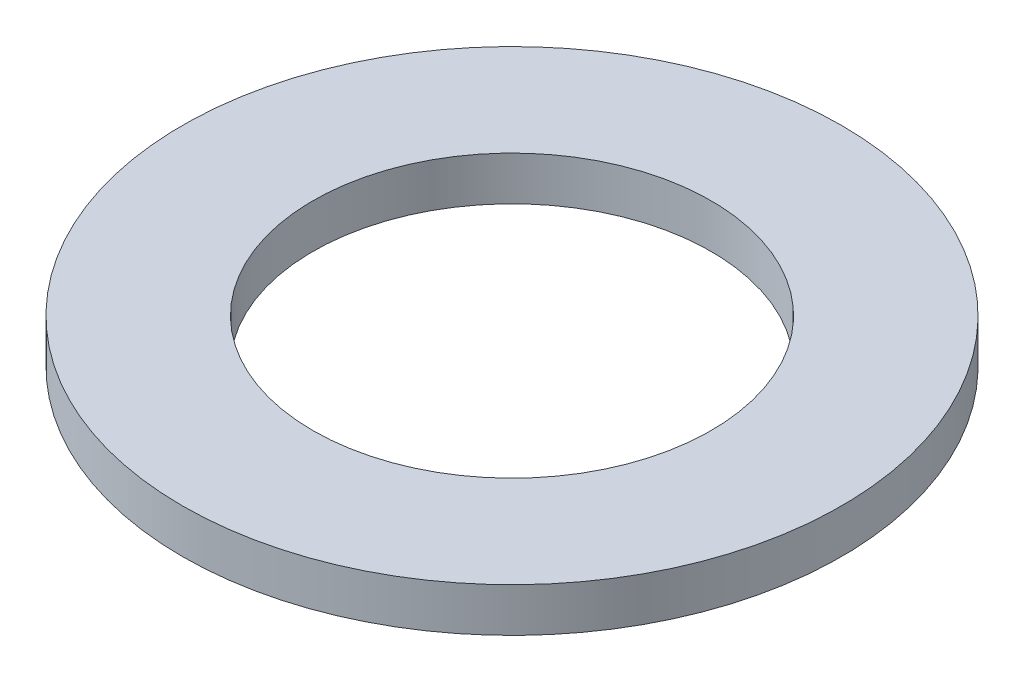
ISO-10303-21;
HEADER;
FILE_DESCRIPTION(('STEP AP214'),'2;1');
FILE_NAME('part.step','',(''),(''),'','','');
FILE_SCHEMA(('AUTOMOTIVE_DESIGN { 1 0 10303 214 1 1 1 1 }'));
ENDSEC;
DATA;
#1=APPLICATION_CONTEXT('core data for automotive mechanical design processes');
#2=APPLICATION_PROTOCOL_DEFINITION('international standard','automotive_design',2000,#1);
#3=PRODUCT_CONTEXT('',#1,'mechanical');
#4=PRODUCT('Part','Part','',(#3));
#5=PRODUCT_RELATED_PRODUCT_CATEGORY('part','',(#4));
#6=PRODUCT_DEFINITION_FORMATION('','',#4);
#7=PRODUCT_DEFINITION_CONTEXT('part definition',#1,'design');
#8=PRODUCT_DEFINITION('design','',#6,#7);
#9=PRODUCT_DEFINITION_SHAPE('','',#8);
#10=(LENGTH_UNIT() NAMED_UNIT(*) SI_UNIT(.MILLI.,.METRE.));
#11=(NAMED_UNIT(*) PLANE_ANGLE_UNIT() SI_UNIT($,.RADIAN.));
#12=(NAMED_UNIT(*) SI_UNIT($,.STERADIAN.) SOLID_ANGLE_UNIT());
#13=UNCERTAINTY_MEASURE_WITH_UNIT(LENGTH_MEASURE(1.E-05),#10,'distance_accuracy_value','');
#14=(GEOMETRIC_REPRESENTATION_CONTEXT(3) GLOBAL_UNCERTAINTY_ASSIGNED_CONTEXT((#13)) GLOBAL_UNIT_ASSIGNED_CONTEXT((#10,
#11,#12)) REPRESENTATION_CONTEXT('',''));
#15=CARTESIAN_POINT('',(0.,0.,0.));
#16=DIRECTION('',(0.,0.,1.));
#17=DIRECTION('',(1.,0.,0.));
#18=AXIS2_PLACEMENT_3D('',#15,#16,#17);
#19=CARTESIAN_POINT('',(0.,1.27,0.));
#20=DIRECTION('',(0.,1.,0.));
#21=DIRECTION('',(0.,0.,1.));
#22=AXIS2_PLACEMENT_3D('',#19,#20,#21);
#23=PLANE('',#22);
#24=CARTESIAN_POINT('',(0.,1.27,0.));
#25=DIRECTION('',(0.,1.,0.));
#26=DIRECTION('',(0.,0.,1.));
#27=AXIS2_PLACEMENT_3D('',#24,#25,#26);
#28=CIRCLE('',#27,9.525);
#29=CARTESIAN_POINT('',(0.,1.27,9.525));
#30=VERTEX_POINT('',#29);
#31=EDGE_CURVE('E10',#30,#30,#28,.T.);
#32=ORIENTED_EDGE('',*,*,#31,.T.);
#33=EDGE_LOOP('',(#32));
#34=FACE_BOUND('',#33,.T.);
#35=CARTESIAN_POINT('',(0.,1.27,0.));
#36=DIRECTION('',(0.,1.,0.));
#37=DIRECTION('',(0.,0.,1.));
#38=AXIS2_PLACEMENT_3D('',#35,#36,#37);
#39=CIRCLE('',#38,5.7546875);
#40=CARTESIAN_POINT('',(0.,1.27,5.7546875));
#41=VERTEX_POINT('',#40);
#42=EDGE_CURVE('E45',#41,#41,#39,.T.);
#43=ORIENTED_EDGE('',*,*,#42,.F.);
#44=EDGE_LOOP('',(#43));
#45=FACE_BOUND('',#44,.T.);
#46=ADVANCED_FACE('F34',(#34,#45),#23,.T.);
#47=CARTESIAN_POINT('',(0.,0.,0.));
#48=DIRECTION('',(0.,1.,0.));
#49=DIRECTION('',(0.,0.,1.));
#50=AXIS2_PLACEMENT_3D('',#47,#48,#49);
#51=PLANE('',#50);
#52=CARTESIAN_POINT('',(0.,0.,0.));
#53=DIRECTION('',(0.,1.,0.));
#54=DIRECTION('',(0.,0.,1.));
#55=AXIS2_PLACEMENT_3D('',#52,#53,#54);
#56=CIRCLE('',#55,9.525);
#57=CARTESIAN_POINT('',(0.,0.,9.525));
#58=VERTEX_POINT('',#57);
#59=EDGE_CURVE('E38',#58,#58,#56,.T.);
#60=ORIENTED_EDGE('',*,*,#59,.F.);
#61=EDGE_LOOP('',(#60));
#62=FACE_BOUND('',#61,.T.);
#63=CARTESIAN_POINT('',(0.,0.,0.));
#64=DIRECTION('',(0.,1.,0.));
#65=DIRECTION('',(0.,0.,1.));
#66=AXIS2_PLACEMENT_3D('',#63,#64,#65);
#67=CIRCLE('',#66,5.7546875);
#68=CARTESIAN_POINT('',(0.,0.,5.7546875));
#69=VERTEX_POINT('',#68);
#70=EDGE_CURVE('E47',#69,#69,#67,.T.);
#71=ORIENTED_EDGE('',*,*,#70,.T.);
#72=EDGE_LOOP('',(#71));
#73=FACE_BOUND('',#72,.T.);
#74=ADVANCED_FACE('F57',(#62,#73),#51,.F.);
#75=CARTESIAN_POINT('',(0.,1.27,0.));
#76=DIRECTION('',(0.,-1.,0.));
#77=DIRECTION('',(0.,0.,-1.));
#78=AXIS2_PLACEMENT_3D('',#75,#76,#77);
#79=CYLINDRICAL_SURFACE('',#78,9.525);
#80=ORIENTED_EDGE('',*,*,#31,.F.);
#81=EDGE_LOOP('',(#80));
#82=FACE_BOUND('',#81,.T.);
#83=ORIENTED_EDGE('',*,*,#59,.T.);
#84=EDGE_LOOP('',(#83));
#85=FACE_BOUND('',#84,.T.);
#86=ADVANCED_FACE('F36',(#82,#85),#79,.T.);
#87=CARTESIAN_POINT('',(0.,1.27,0.));
#88=DIRECTION('',(0.,-1.,0.));
#89=DIRECTION('',(0.,0.,-1.));
#90=AXIS2_PLACEMENT_3D('',#87,#88,#89);
#91=CYLINDRICAL_SURFACE('',#90,5.7546875);
#92=ORIENTED_EDGE('',*,*,#42,.T.);
#93=EDGE_LOOP('',(#92));
#94=FACE_BOUND('',#93,.T.);
#95=ORIENTED_EDGE('',*,*,#70,.F.);
#96=EDGE_LOOP('',(#95));
#97=FACE_BOUND('',#96,.T.);
#98=ADVANCED_FACE('F53',(#94,#97),#91,.F.);
#99=CLOSED_SHELL('',(#46,#74,#86,#98));
#100=MANIFOLD_SOLID_BREP('B2',#99);
#101=ADVANCED_BREP_SHAPE_REPRESENTATION('',(#18,#100),#14);
#102=SHAPE_DEFINITION_REPRESENTATION(#9,#101);
ENDSEC;
END-ISO-10303-21;
